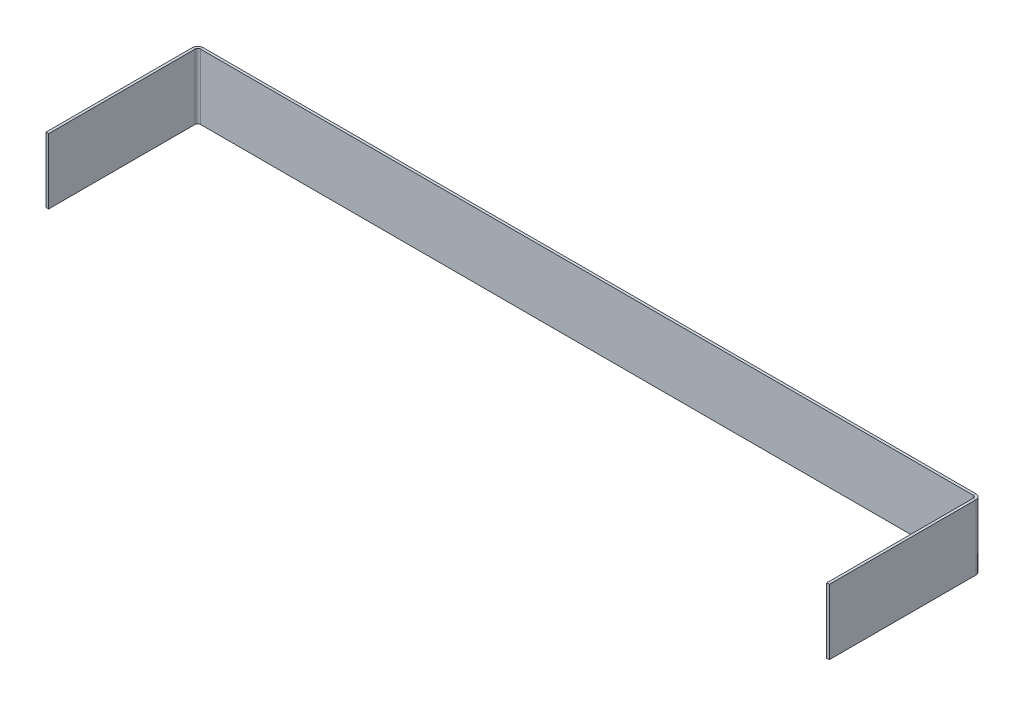
ISO-10303-21;
HEADER;
FILE_DESCRIPTION(('STEP AP214'),'2;1');
FILE_NAME('part.step','',(''),(''),'','','');
FILE_SCHEMA(('AUTOMOTIVE_DESIGN { 1 0 10303 214 1 1 1 1 }'));
ENDSEC;
DATA;
#1=APPLICATION_CONTEXT('core data for automotive mechanical design processes');
#2=APPLICATION_PROTOCOL_DEFINITION('international standard','automotive_design',2000,#1);
#3=PRODUCT_CONTEXT('',#1,'mechanical');
#4=PRODUCT('Part','Part','',(#3));
#5=PRODUCT_RELATED_PRODUCT_CATEGORY('part','',(#4));
#6=PRODUCT_DEFINITION_FORMATION('','',#4);
#7=PRODUCT_DEFINITION_CONTEXT('part definition',#1,'design');
#8=PRODUCT_DEFINITION('design','',#6,#7);
#9=PRODUCT_DEFINITION_SHAPE('','',#8);
#10=(LENGTH_UNIT() NAMED_UNIT(*) SI_UNIT(.MILLI.,.METRE.));
#11=(NAMED_UNIT(*) PLANE_ANGLE_UNIT() SI_UNIT($,.RADIAN.));
#12=(NAMED_UNIT(*) SI_UNIT($,.STERADIAN.) SOLID_ANGLE_UNIT());
#13=UNCERTAINTY_MEASURE_WITH_UNIT(LENGTH_MEASURE(1.E-05),#10,'distance_accuracy_value','');
#14=(GEOMETRIC_REPRESENTATION_CONTEXT(3) GLOBAL_UNCERTAINTY_ASSIGNED_CONTEXT((#13)) GLOBAL_UNIT_ASSIGNED_CONTEXT((#10,
#11,#12)) REPRESENTATION_CONTEXT('',''));
#15=CARTESIAN_POINT('',(0.,0.,0.));
#16=DIRECTION('',(0.,0.,1.));
#17=DIRECTION('',(1.,0.,0.));
#18=AXIS2_PLACEMENT_3D('',#15,#16,#17);
#19=CARTESIAN_POINT('',(0.,-50.,2.));
#20=DIRECTION('',(0.,1.,0.));
#21=DIRECTION('',(0.,0.,1.));
#22=AXIS2_PLACEMENT_3D('',#19,#20,#21);
#23=PLANE('',#22);
#24=DIRECTION('',(0.,0.,-1.));
#25=VECTOR('',#24,1.);
#26=CARTESIAN_POINT('',(596.,-50.,2.00000000000001));
#27=LINE('',#26,#25);
#28=CARTESIAN_POINT('',(596.,-50.,2.00000000000001));
#29=VERTEX_POINT('',#28);
#30=CARTESIAN_POINT('',(596.,-50.,0.));
#31=VERTEX_POINT('',#30);
#32=EDGE_CURVE('E228',#29,#31,#27,.T.);
#33=ORIENTED_EDGE('',*,*,#32,.F.);
#34=DIRECTION('',(1.,0.,0.));
#35=VECTOR('',#34,1.);
#36=CARTESIAN_POINT('',(0.,-50.,2.));
#37=LINE('',#36,#35);
#38=CARTESIAN_POINT('',(4.00000000000001,-50.,2.00000000000001));
#39=VERTEX_POINT('',#38);
#40=EDGE_CURVE('E89',#39,#29,#37,.T.);
#41=ORIENTED_EDGE('',*,*,#40,.F.);
#42=DIRECTION('',(0.,0.,-1.));
#43=VECTOR('',#42,1.);
#44=CARTESIAN_POINT('',(4.00000000000001,-50.,2.00000000000001));
#45=LINE('',#44,#43);
#46=CARTESIAN_POINT('',(4.,-50.,0.));
#47=VERTEX_POINT('',#46);
#48=EDGE_CURVE('E268',#39,#47,#45,.T.);
#49=ORIENTED_EDGE('',*,*,#48,.T.);
#50=DIRECTION('',(1.,0.,0.));
#51=VECTOR('',#50,1.);
#52=CARTESIAN_POINT('',(0.,-50.,0.));
#53=LINE('',#52,#51);
#54=EDGE_CURVE('E280',#47,#31,#53,.T.);
#55=ORIENTED_EDGE('',*,*,#54,.T.);
#56=EDGE_LOOP('',(#33,#41,#49,#55));
#57=FACE_BOUND('',#56,.T.);
#58=ADVANCED_FACE('F81',(#57),#23,.F.);
#59=CARTESIAN_POINT('',(0.,0.,2.));
#60=DIRECTION('',(0.,-1.,0.));
#61=DIRECTION('',(1.,0.,0.));
#62=AXIS2_PLACEMENT_3D('',#59,#60,#61);
#63=PLANE('',#62);
#64=DIRECTION('',(0.,0.,-1.));
#65=VECTOR('',#64,1.);
#66=CARTESIAN_POINT('',(596.,0.,2.00000000000001));
#67=LINE('',#66,#65);
#68=CARTESIAN_POINT('',(596.,0.,2.00000000000001));
#69=VERTEX_POINT('',#68);
#70=CARTESIAN_POINT('',(596.,0.,0.));
#71=VERTEX_POINT('',#70);
#72=EDGE_CURVE('E217',#69,#71,#67,.T.);
#73=ORIENTED_EDGE('',*,*,#72,.T.);
#74=DIRECTION('',(-1.,0.,0.));
#75=VECTOR('',#74,1.);
#76=CARTESIAN_POINT('',(0.,0.,0.));
#77=LINE('',#76,#75);
#78=CARTESIAN_POINT('',(3.99999999999998,0.,0.));
#79=VERTEX_POINT('',#78);
#80=EDGE_CURVE('E84',#71,#79,#77,.T.);
#81=ORIENTED_EDGE('',*,*,#80,.T.);
#82=DIRECTION('',(0.,0.,-1.));
#83=VECTOR('',#82,1.);
#84=CARTESIAN_POINT('',(3.99999999999998,0.,2.00000000000001));
#85=LINE('',#84,#83);
#86=CARTESIAN_POINT('',(3.99999999999998,0.,2.00000000000001));
#87=VERTEX_POINT('',#86);
#88=EDGE_CURVE('E278',#87,#79,#85,.T.);
#89=ORIENTED_EDGE('',*,*,#88,.F.);
#90=DIRECTION('',(-1.,0.,0.));
#91=VECTOR('',#90,1.);
#92=CARTESIAN_POINT('',(0.,0.,2.));
#93=LINE('',#92,#91);
#94=EDGE_CURVE('E13',#69,#87,#93,.T.);
#95=ORIENTED_EDGE('',*,*,#94,.F.);
#96=EDGE_LOOP('',(#73,#81,#89,#95));
#97=FACE_BOUND('',#96,.T.);
#98=ADVANCED_FACE('F292',(#97),#63,.F.);
#99=CARTESIAN_POINT('',(0.,0.,2.));
#100=DIRECTION('',(0.,0.,-1.));
#101=DIRECTION('',(-1.,0.,0.));
#102=AXIS2_PLACEMENT_3D('',#99,#100,#101);
#103=PLANE('',#102);
#104=DIRECTION('',(0.,1.,0.));
#105=VECTOR('',#104,1.);
#106=CARTESIAN_POINT('',(596.,0.,2.00000000000001));
#107=LINE('',#106,#105);
#108=EDGE_CURVE('E223',#69,#29,#107,.F.);
#109=ORIENTED_EDGE('',*,*,#108,.F.);
#110=ORIENTED_EDGE('',*,*,#94,.T.);
#111=DIRECTION('',(0.,-1.,0.));
#112=VECTOR('',#111,1.);
#113=CARTESIAN_POINT('',(4.00000000000001,-50.,2.00000000000001));
#114=LINE('',#113,#112);
#115=EDGE_CURVE('E274',#39,#87,#114,.F.);
#116=ORIENTED_EDGE('',*,*,#115,.F.);
#117=ORIENTED_EDGE('',*,*,#40,.T.);
#118=EDGE_LOOP('',(#109,#110,#116,#117));
#119=FACE_BOUND('',#118,.T.);
#120=ADVANCED_FACE('F306',(#119),#103,.F.);
#121=CARTESIAN_POINT('',(0.,0.,0.));
#122=DIRECTION('',(0.,0.,-1.));
#123=DIRECTION('',(-1.,0.,0.));
#124=AXIS2_PLACEMENT_3D('',#121,#122,#123);
#125=PLANE('',#124);
#126=ORIENTED_EDGE('',*,*,#80,.F.);
#127=DIRECTION('',(0.,1.,0.));
#128=VECTOR('',#127,1.);
#129=CARTESIAN_POINT('',(596.,0.,0.));
#130=LINE('',#129,#128);
#131=EDGE_CURVE('E212',#71,#31,#130,.F.);
#132=ORIENTED_EDGE('',*,*,#131,.T.);
#133=ORIENTED_EDGE('',*,*,#54,.F.);
#134=DIRECTION('',(0.,-1.,0.));
#135=VECTOR('',#134,1.);
#136=CARTESIAN_POINT('',(4.,-50.,0.));
#137=LINE('',#136,#135);
#138=EDGE_CURVE('E263',#47,#79,#137,.F.);
#139=ORIENTED_EDGE('',*,*,#138,.T.);
#140=EDGE_LOOP('',(#126,#132,#133,#139));
#141=FACE_BOUND('',#140,.T.);
#142=ADVANCED_FACE('F295',(#141),#125,.T.);
#143=CARTESIAN_POINT('',(3.99999999999999,0.,4.));
#144=DIRECTION('',(0.,1.,0.));
#145=DIRECTION('',(-1.,0.,0.));
#146=AXIS2_PLACEMENT_3D('',#143,#144,#145);
#147=PLANE('',#146);
#148=DIRECTION('',(1.,0.,0.));
#149=VECTOR('',#148,1.);
#150=CARTESIAN_POINT('',(0.,0.,3.99999999999999));
#151=LINE('',#150,#149);
#152=CARTESIAN_POINT('',(1.99999999999999,0.,3.99999999999999));
#153=VERTEX_POINT('',#152);
#154=CARTESIAN_POINT('',(0.,0.,3.99999999999999));
#155=VERTEX_POINT('',#154);
#156=EDGE_CURVE('E230',#153,#155,#151,.F.);
#157=ORIENTED_EDGE('',*,*,#156,.F.);
#158=CARTESIAN_POINT('',(3.99999999999999,0.,4.));
#159=DIRECTION('',(0.,-1.,0.));
#160=DIRECTION('',(1.,0.,0.));
#161=AXIS2_PLACEMENT_3D('',#158,#159,#160);
#162=CIRCLE('',#161,1.99999999999999);
#163=EDGE_CURVE('E271',#87,#153,#162,.F.);
#164=ORIENTED_EDGE('',*,*,#163,.F.);
#165=ORIENTED_EDGE('',*,*,#88,.T.);
#166=CARTESIAN_POINT('',(3.99999999999999,0.,4.));
#167=DIRECTION('',(0.,-1.,0.));
#168=DIRECTION('',(1.,0.,0.));
#169=AXIS2_PLACEMENT_3D('',#166,#167,#168);
#170=CIRCLE('',#169,3.99999999999999);
#171=EDGE_CURVE('E105',#79,#155,#170,.F.);
#172=ORIENTED_EDGE('',*,*,#171,.T.);
#173=EDGE_LOOP('',(#157,#164,#165,#172));
#174=FACE_BOUND('',#173,.T.);
#175=ADVANCED_FACE('F312',(#174),#147,.T.);
#176=CARTESIAN_POINT('',(4.00000000000001,-50.,4.));
#177=DIRECTION('',(0.,1.,0.));
#178=DIRECTION('',(-1.,0.,0.));
#179=AXIS2_PLACEMENT_3D('',#176,#177,#178);
#180=PLANE('',#179);
#181=CARTESIAN_POINT('',(4.00000000000001,-50.,4.));
#182=DIRECTION('',(0.,-1.,0.));
#183=DIRECTION('',(1.,0.,0.));
#184=AXIS2_PLACEMENT_3D('',#181,#182,#183);
#185=CIRCLE('',#184,1.99999999999999);
#186=CARTESIAN_POINT('',(2.00000000000002,-50.,3.99999999999999));
#187=VERTEX_POINT('',#186);
#188=EDGE_CURVE('E236',#187,#39,#185,.T.);
#189=ORIENTED_EDGE('',*,*,#188,.F.);
#190=DIRECTION('',(1.,0.,0.));
#191=VECTOR('',#190,1.);
#192=CARTESIAN_POINT('',(2.00000000000001,-50.,4.));
#193=LINE('',#192,#191);
#194=CARTESIAN_POINT('',(0.,-50.,3.99999999999999));
#195=VERTEX_POINT('',#194);
#196=EDGE_CURVE('E256',#187,#195,#193,.F.);
#197=ORIENTED_EDGE('',*,*,#196,.T.);
#198=CARTESIAN_POINT('',(4.00000000000001,-50.,4.));
#199=DIRECTION('',(0.,-1.,0.));
#200=DIRECTION('',(1.,0.,0.));
#201=AXIS2_PLACEMENT_3D('',#198,#199,#200);
#202=CIRCLE('',#201,3.99999999999999);
#203=EDGE_CURVE('E266',#195,#47,#202,.T.);
#204=ORIENTED_EDGE('',*,*,#203,.T.);
#205=ORIENTED_EDGE('',*,*,#48,.F.);
#206=EDGE_LOOP('',(#189,#197,#204,#205));
#207=FACE_BOUND('',#206,.T.);
#208=ADVANCED_FACE('F299',(#207),#180,.F.);
#209=CARTESIAN_POINT('',(4.00000000000001,-50.,4.));
#210=DIRECTION('',(0.,-1.,0.));
#211=DIRECTION('',(-1.,0.,0.));
#212=AXIS2_PLACEMENT_3D('',#209,#210,#211);
#213=CYLINDRICAL_SURFACE('',#212,3.99999999999999);
#214=ORIENTED_EDGE('',*,*,#138,.F.);
#215=ORIENTED_EDGE('',*,*,#203,.F.);
#216=DIRECTION('',(0.,-1.,0.));
#217=VECTOR('',#216,1.);
#218=CARTESIAN_POINT('',(0.,0.,3.99999999999999));
#219=LINE('',#218,#217);
#220=EDGE_CURVE('E254',#195,#155,#219,.F.);
#221=ORIENTED_EDGE('',*,*,#220,.T.);
#222=ORIENTED_EDGE('',*,*,#171,.F.);
#223=EDGE_LOOP('',(#214,#215,#221,#222));
#224=FACE_BOUND('',#223,.T.);
#225=ADVANCED_FACE('F296',(#224),#213,.T.);
#226=CARTESIAN_POINT('',(4.00000000000001,-50.,4.));
#227=DIRECTION('',(0.,-1.,0.));
#228=DIRECTION('',(-1.,0.,0.));
#229=AXIS2_PLACEMENT_3D('',#226,#227,#228);
#230=CYLINDRICAL_SURFACE('',#229,1.99999999999999);
#231=ORIENTED_EDGE('',*,*,#115,.T.);
#232=ORIENTED_EDGE('',*,*,#163,.T.);
#233=DIRECTION('',(0.,-1.,0.));
#234=VECTOR('',#233,1.);
#235=CARTESIAN_POINT('',(1.99999999999999,0.,3.99999999999999));
#236=LINE('',#235,#234);
#237=EDGE_CURVE('E259',#153,#187,#236,.T.);
#238=ORIENTED_EDGE('',*,*,#237,.T.);
#239=ORIENTED_EDGE('',*,*,#188,.T.);
#240=EDGE_LOOP('',(#231,#232,#238,#239));
#241=FACE_BOUND('',#240,.T.);
#242=ADVANCED_FACE('F309',(#241),#230,.F.);
#243=CARTESIAN_POINT('',(0.,0.,1.99999999999999));
#244=DIRECTION('',(0.,-1.,0.));
#245=DIRECTION('',(1.,0.,0.));
#246=AXIS2_PLACEMENT_3D('',#243,#244,#245);
#247=PLANE('',#246);
#248=ORIENTED_EDGE('',*,*,#156,.T.);
#249=DIRECTION('',(0.,0.,-1.));
#250=VECTOR('',#249,1.);
#251=CARTESIAN_POINT('',(0.,0.,0.));
#252=LINE('',#251,#250);
#253=CARTESIAN_POINT('',(-3.98945811736607E-13,0.,116.25));
#254=VERTEX_POINT('',#253);
#255=EDGE_CURVE('E244',#254,#155,#252,.T.);
#256=ORIENTED_EDGE('',*,*,#255,.F.);
#257=DIRECTION('',(1.,0.,0.));
#258=VECTOR('',#257,1.);
#259=CARTESIAN_POINT('',(-3.98901742962828E-13,0.,116.25));
#260=LINE('',#259,#258);
#261=CARTESIAN_POINT('',(1.9999999999996,0.,116.25));
#262=VERTEX_POINT('',#261);
#263=EDGE_CURVE('E237',#254,#262,#260,.T.);
#264=ORIENTED_EDGE('',*,*,#263,.T.);
#265=DIRECTION('',(0.,0.,1.));
#266=VECTOR('',#265,1.);
#267=CARTESIAN_POINT('',(2.,0.,2.));
#268=LINE('',#267,#266);
#269=EDGE_CURVE('E251',#262,#153,#268,.F.);
#270=ORIENTED_EDGE('',*,*,#269,.T.);
#271=EDGE_LOOP('',(#248,#256,#264,#270));
#272=FACE_BOUND('',#271,.T.);
#273=ADVANCED_FACE('F315',(#272),#247,.F.);
#274=CARTESIAN_POINT('',(-3.86843335142828E-13,-50.,116.25));
#275=DIRECTION('',(0.,1.,0.));
#276=DIRECTION('',(-1.,0.,0.));
#277=AXIS2_PLACEMENT_3D('',#274,#275,#276);
#278=PLANE('',#277);
#279=ORIENTED_EDGE('',*,*,#196,.F.);
#280=DIRECTION('',(0.,0.,-1.));
#281=VECTOR('',#280,1.);
#282=CARTESIAN_POINT('',(1.99999999999961,-50.,116.25));
#283=LINE('',#282,#281);
#284=CARTESIAN_POINT('',(1.99999999999961,-50.,116.25));
#285=VERTEX_POINT('',#284);
#286=EDGE_CURVE('E249',#187,#285,#283,.F.);
#287=ORIENTED_EDGE('',*,*,#286,.T.);
#288=DIRECTION('',(1.,0.,0.));
#289=VECTOR('',#288,1.);
#290=CARTESIAN_POINT('',(-3.86739931483192E-13,-50.,116.25));
#291=LINE('',#290,#289);
#292=CARTESIAN_POINT('',(-3.86699343745133E-13,-50.,116.25));
#293=VERTEX_POINT('',#292);
#294=EDGE_CURVE('E233',#293,#285,#291,.T.);
#295=ORIENTED_EDGE('',*,*,#294,.F.);
#296=DIRECTION('',(0.,0.,1.));
#297=VECTOR('',#296,1.);
#298=CARTESIAN_POINT('',(0.,-50.,0.));
#299=LINE('',#298,#297);
#300=EDGE_CURVE('E242',#195,#293,#299,.T.);
#301=ORIENTED_EDGE('',*,*,#300,.F.);
#302=EDGE_LOOP('',(#279,#287,#295,#301));
#303=FACE_BOUND('',#302,.T.);
#304=ADVANCED_FACE('F330',(#303),#278,.F.);
#305=CARTESIAN_POINT('',(0.,0.,0.));
#306=DIRECTION('',(1.,0.,0.));
#307=DIRECTION('',(0.,0.,-1.));
#308=AXIS2_PLACEMENT_3D('',#305,#306,#307);
#309=PLANE('',#308);
#310=ORIENTED_EDGE('',*,*,#220,.F.);
#311=ORIENTED_EDGE('',*,*,#300,.T.);
#312=DIRECTION('',(0.,1.,0.));
#313=VECTOR('',#312,1.);
#314=CARTESIAN_POINT('',(-3.98945811736607E-13,0.,116.25));
#315=LINE('',#314,#313);
#316=EDGE_CURVE('E240',#293,#254,#315,.T.);
#317=ORIENTED_EDGE('',*,*,#316,.T.);
#318=ORIENTED_EDGE('',*,*,#255,.T.);
#319=EDGE_LOOP('',(#310,#311,#317,#318));
#320=FACE_BOUND('',#319,.T.);
#321=ADVANCED_FACE('F318',(#320),#309,.F.);
#322=CARTESIAN_POINT('',(2.00000000000001,0.,0.));
#323=DIRECTION('',(1.,0.,0.));
#324=DIRECTION('',(0.,0.,-1.));
#325=AXIS2_PLACEMENT_3D('',#322,#323,#324);
#326=PLANE('',#325);
#327=ORIENTED_EDGE('',*,*,#286,.F.);
#328=ORIENTED_EDGE('',*,*,#237,.F.);
#329=ORIENTED_EDGE('',*,*,#269,.F.);
#330=DIRECTION('',(0.,-1.,0.));
#331=VECTOR('',#330,1.);
#332=CARTESIAN_POINT('',(1.9999999999996,0.,116.25));
#333=LINE('',#332,#331);
#334=EDGE_CURVE('E247',#285,#262,#333,.F.);
#335=ORIENTED_EDGE('',*,*,#334,.F.);
#336=EDGE_LOOP('',(#327,#328,#329,#335));
#337=FACE_BOUND('',#336,.T.);
#338=ADVANCED_FACE('F328',(#337),#326,.T.);
#339=CARTESIAN_POINT('',(-3.98986399474666E-13,0.,116.25));
#340=DIRECTION('',(0.,0.,-1.));
#341=DIRECTION('',(-1.,0.,0.));
#342=AXIS2_PLACEMENT_3D('',#339,#340,#341);
#343=PLANE('',#342);
#344=ORIENTED_EDGE('',*,*,#334,.T.);
#345=ORIENTED_EDGE('',*,*,#263,.F.);
#346=ORIENTED_EDGE('',*,*,#316,.F.);
#347=ORIENTED_EDGE('',*,*,#294,.T.);
#348=EDGE_LOOP('',(#344,#345,#346,#347));
#349=FACE_BOUND('',#348,.T.);
#350=ADVANCED_FACE('F324',(#349),#343,.F.);
#351=CARTESIAN_POINT('',(596.,-50.,4.00000000000001));
#352=DIRECTION('',(0.,-1.,0.));
#353=DIRECTION('',(0.,0.,-1.));
#354=AXIS2_PLACEMENT_3D('',#351,#352,#353);
#355=PLANE('',#354);
#356=DIRECTION('',(-1.,0.,0.));
#357=VECTOR('',#356,1.);
#358=CARTESIAN_POINT('',(600.,-50.,4.));
#359=LINE('',#358,#357);
#360=CARTESIAN_POINT('',(598.,-50.,4.));
#361=VERTEX_POINT('',#360);
#362=CARTESIAN_POINT('',(600.,-50.,4.));
#363=VERTEX_POINT('',#362);
#364=EDGE_CURVE('E195',#361,#363,#359,.F.);
#365=ORIENTED_EDGE('',*,*,#364,.F.);
#366=CARTESIAN_POINT('',(596.,-50.,4.00000000000001));
#367=DIRECTION('',(0.,1.,0.));
#368=DIRECTION('',(0.,0.,1.));
#369=AXIS2_PLACEMENT_3D('',#366,#367,#368);
#370=CIRCLE('',#369,2.);
#371=EDGE_CURVE('E220',#29,#361,#370,.F.);
#372=ORIENTED_EDGE('',*,*,#371,.F.);
#373=ORIENTED_EDGE('',*,*,#32,.T.);
#374=CARTESIAN_POINT('',(596.,-50.,4.00000000000001));
#375=DIRECTION('',(0.,1.,0.));
#376=DIRECTION('',(0.,0.,1.));
#377=AXIS2_PLACEMENT_3D('',#374,#375,#376);
#378=CIRCLE('',#377,4.);
#379=EDGE_CURVE('E97',#31,#363,#378,.F.);
#380=ORIENTED_EDGE('',*,*,#379,.T.);
#381=EDGE_LOOP('',(#365,#372,#373,#380));
#382=FACE_BOUND('',#381,.T.);
#383=ADVANCED_FACE('F401',(#382),#355,.T.);
#384=CARTESIAN_POINT('',(596.,0.,4.00000000000001));
#385=DIRECTION('',(0.,-1.,0.));
#386=DIRECTION('',(0.,0.,-1.));
#387=AXIS2_PLACEMENT_3D('',#384,#385,#386);
#388=PLANE('',#387);
#389=CARTESIAN_POINT('',(596.,0.,4.00000000000001));
#390=DIRECTION('',(0.,1.,0.));
#391=DIRECTION('',(0.,0.,1.));
#392=AXIS2_PLACEMENT_3D('',#389,#390,#391);
#393=CIRCLE('',#392,2.);
#394=CARTESIAN_POINT('',(598.,0.,4.));
#395=VERTEX_POINT('',#394);
#396=EDGE_CURVE('E225',#395,#69,#393,.T.);
#397=ORIENTED_EDGE('',*,*,#396,.F.);
#398=DIRECTION('',(-1.,0.,0.));
#399=VECTOR('',#398,1.);
#400=CARTESIAN_POINT('',(598.,0.,4.));
#401=LINE('',#400,#399);
#402=CARTESIAN_POINT('',(600.,0.,4.));
#403=VERTEX_POINT('',#402);
#404=EDGE_CURVE('E206',#395,#403,#401,.F.);
#405=ORIENTED_EDGE('',*,*,#404,.T.);
#406=CARTESIAN_POINT('',(596.,0.,4.00000000000001));
#407=DIRECTION('',(0.,1.,0.));
#408=DIRECTION('',(0.,0.,1.));
#409=AXIS2_PLACEMENT_3D('',#406,#407,#408);
#410=CIRCLE('',#409,4.);
#411=EDGE_CURVE('E215',#403,#71,#410,.T.);
#412=ORIENTED_EDGE('',*,*,#411,.T.);
#413=ORIENTED_EDGE('',*,*,#72,.F.);
#414=EDGE_LOOP('',(#397,#405,#412,#413));
#415=FACE_BOUND('',#414,.T.);
#416=ADVANCED_FACE('F410',(#415),#388,.F.);
#417=CARTESIAN_POINT('',(596.,0.,4.00000000000001));
#418=DIRECTION('',(0.,1.,0.));
#419=DIRECTION('',(1.,0.,0.));
#420=AXIS2_PLACEMENT_3D('',#417,#418,#419);
#421=CYLINDRICAL_SURFACE('',#420,4.);
#422=ORIENTED_EDGE('',*,*,#131,.F.);
#423=ORIENTED_EDGE('',*,*,#411,.F.);
#424=DIRECTION('',(0.,1.,0.));
#425=VECTOR('',#424,1.);
#426=CARTESIAN_POINT('',(600.,-50.,4.));
#427=LINE('',#426,#425);
#428=EDGE_CURVE('E204',#403,#363,#427,.F.);
#429=ORIENTED_EDGE('',*,*,#428,.T.);
#430=ORIENTED_EDGE('',*,*,#379,.F.);
#431=EDGE_LOOP('',(#422,#423,#429,#430));
#432=FACE_BOUND('',#431,.T.);
#433=ADVANCED_FACE('F421',(#432),#421,.T.);
#434=CARTESIAN_POINT('',(596.,0.,4.00000000000001));
#435=DIRECTION('',(0.,1.,0.));
#436=DIRECTION('',(1.,0.,0.));
#437=AXIS2_PLACEMENT_3D('',#434,#435,#436);
#438=CYLINDRICAL_SURFACE('',#437,2.);
#439=ORIENTED_EDGE('',*,*,#108,.T.);
#440=ORIENTED_EDGE('',*,*,#371,.T.);
#441=DIRECTION('',(0.,1.,0.));
#442=VECTOR('',#441,1.);
#443=CARTESIAN_POINT('',(598.,-50.,4.));
#444=LINE('',#443,#442);
#445=EDGE_CURVE('E209',#361,#395,#444,.T.);
#446=ORIENTED_EDGE('',*,*,#445,.T.);
#447=ORIENTED_EDGE('',*,*,#396,.T.);
#448=EDGE_LOOP('',(#439,#440,#446,#447));
#449=FACE_BOUND('',#448,.T.);
#450=ADVANCED_FACE('F432',(#449),#438,.F.);
#451=CARTESIAN_POINT('',(600.,-50.,1.99999999999999));
#452=DIRECTION('',(0.,1.,0.));
#453=DIRECTION('',(0.,0.,1.));
#454=AXIS2_PLACEMENT_3D('',#451,#452,#453);
#455=PLANE('',#454);
#456=ORIENTED_EDGE('',*,*,#364,.T.);
#457=DIRECTION('',(0.,0.,-1.));
#458=VECTOR('',#457,1.);
#459=CARTESIAN_POINT('',(600.,-50.,-2.3391801260041E-12));
#460=LINE('',#459,#458);
#461=CARTESIAN_POINT('',(600.,-50.,116.249999999998));
#462=VERTEX_POINT('',#461);
#463=EDGE_CURVE('E176',#462,#363,#460,.T.);
#464=ORIENTED_EDGE('',*,*,#463,.F.);
#465=DIRECTION('',(-1.,0.,0.));
#466=VECTOR('',#465,1.);
#467=CARTESIAN_POINT('',(600.,-50.,116.249999999998));
#468=LINE('',#467,#466);
#469=CARTESIAN_POINT('',(598.,-50.,116.249999999998));
#470=VERTEX_POINT('',#469);
#471=EDGE_CURVE('E182',#462,#470,#468,.T.);
#472=ORIENTED_EDGE('',*,*,#471,.T.);
#473=DIRECTION('',(0.,0.,1.));
#474=VECTOR('',#473,1.);
#475=CARTESIAN_POINT('',(598.,-50.,2.));
#476=LINE('',#475,#474);
#477=EDGE_CURVE('E202',#470,#361,#476,.F.);
#478=ORIENTED_EDGE('',*,*,#477,.T.);
#479=EDGE_LOOP('',(#456,#464,#472,#478));
#480=FACE_BOUND('',#479,.T.);
#481=ADVANCED_FACE('F194',(#480),#455,.F.);
#482=CARTESIAN_POINT('',(600.,0.,116.249999999998));
#483=DIRECTION('',(0.,-1.,0.));
#484=DIRECTION('',(0.,0.,-1.));
#485=AXIS2_PLACEMENT_3D('',#482,#483,#484);
#486=PLANE('',#485);
#487=ORIENTED_EDGE('',*,*,#404,.F.);
#488=DIRECTION('',(0.,0.,-1.));
#489=VECTOR('',#488,1.);
#490=CARTESIAN_POINT('',(598.,0.,116.249999999998));
#491=LINE('',#490,#489);
#492=CARTESIAN_POINT('',(598.,0.,116.249999999998));
#493=VERTEX_POINT('',#492);
#494=EDGE_CURVE('E198',#395,#493,#491,.F.);
#495=ORIENTED_EDGE('',*,*,#494,.T.);
#496=DIRECTION('',(-1.,0.,0.));
#497=VECTOR('',#496,1.);
#498=CARTESIAN_POINT('',(600.,0.,116.249999999998));
#499=LINE('',#498,#497);
#500=CARTESIAN_POINT('',(600.,0.,116.249999999998));
#501=VERTEX_POINT('',#500);
#502=EDGE_CURVE('E191',#501,#493,#499,.T.);
#503=ORIENTED_EDGE('',*,*,#502,.F.);
#504=DIRECTION('',(0.,0.,1.));
#505=VECTOR('',#504,1.);
#506=CARTESIAN_POINT('',(600.,0.,-2.3391801260041E-12));
#507=LINE('',#506,#505);
#508=EDGE_CURVE('E178',#403,#501,#507,.T.);
#509=ORIENTED_EDGE('',*,*,#508,.F.);
#510=EDGE_LOOP('',(#487,#495,#503,#509));
#511=FACE_BOUND('',#510,.T.);
#512=ADVANCED_FACE('F452',(#511),#486,.F.);
#513=CARTESIAN_POINT('',(600.,0.,-2.3391801260041E-12));
#514=DIRECTION('',(-1.,0.,0.));
#515=DIRECTION('',(0.,0.,1.));
#516=AXIS2_PLACEMENT_3D('',#513,#514,#515);
#517=PLANE('',#516);
#518=ORIENTED_EDGE('',*,*,#428,.F.);
#519=ORIENTED_EDGE('',*,*,#508,.T.);
#520=DIRECTION('',(0.,-1.,0.));
#521=VECTOR('',#520,1.);
#522=CARTESIAN_POINT('',(600.,0.,116.249999999998));
#523=LINE('',#522,#521);
#524=EDGE_CURVE('E171',#501,#462,#523,.T.);
#525=ORIENTED_EDGE('',*,*,#524,.T.);
#526=ORIENTED_EDGE('',*,*,#463,.T.);
#527=EDGE_LOOP('',(#518,#519,#525,#526));
#528=FACE_BOUND('',#527,.T.);
#529=ADVANCED_FACE('F174',(#528),#517,.F.);
#530=CARTESIAN_POINT('',(598.,0.,-2.33219716332641E-12));
#531=DIRECTION('',(-1.,0.,0.));
#532=DIRECTION('',(0.,0.,1.));
#533=AXIS2_PLACEMENT_3D('',#530,#531,#532);
#534=PLANE('',#533);
#535=ORIENTED_EDGE('',*,*,#494,.F.);
#536=ORIENTED_EDGE('',*,*,#445,.F.);
#537=ORIENTED_EDGE('',*,*,#477,.F.);
#538=DIRECTION('',(0.,1.,0.));
#539=VECTOR('',#538,1.);
#540=CARTESIAN_POINT('',(598.,-50.,116.249999999998));
#541=LINE('',#540,#539);
#542=EDGE_CURVE('E187',#493,#470,#541,.F.);
#543=ORIENTED_EDGE('',*,*,#542,.F.);
#544=EDGE_LOOP('',(#535,#536,#537,#543));
#545=FACE_BOUND('',#544,.T.);
#546=ADVANCED_FACE('F472',(#545),#534,.T.);
#547=CARTESIAN_POINT('',(600.,-50.,116.249999999998));
#548=DIRECTION('',(0.,0.,-1.));
#549=DIRECTION('',(-1.,0.,0.));
#550=AXIS2_PLACEMENT_3D('',#547,#548,#549);
#551=PLANE('',#550);
#552=ORIENTED_EDGE('',*,*,#542,.T.);
#553=ORIENTED_EDGE('',*,*,#471,.F.);
#554=ORIENTED_EDGE('',*,*,#524,.F.);
#555=ORIENTED_EDGE('',*,*,#502,.T.);
#556=EDGE_LOOP('',(#552,#553,#554,#555));
#557=FACE_BOUND('',#556,.T.);
#558=ADVANCED_FACE('F185',(#557),#551,.F.);
#559=CLOSED_SHELL('',(#58,#98,#120,#142,#175,#208,#225,#242,#273,#304,#321,#338,#350,#383,#416,
#433,#450,#481,#512,#529,#546,#558));
#560=MANIFOLD_SOLID_BREP('B2',#559);
#561=ADVANCED_BREP_SHAPE_REPRESENTATION('',(#18,#560),#14);
#562=SHAPE_DEFINITION_REPRESENTATION(#9,#561);
ENDSEC;
END-ISO-10303-21;
